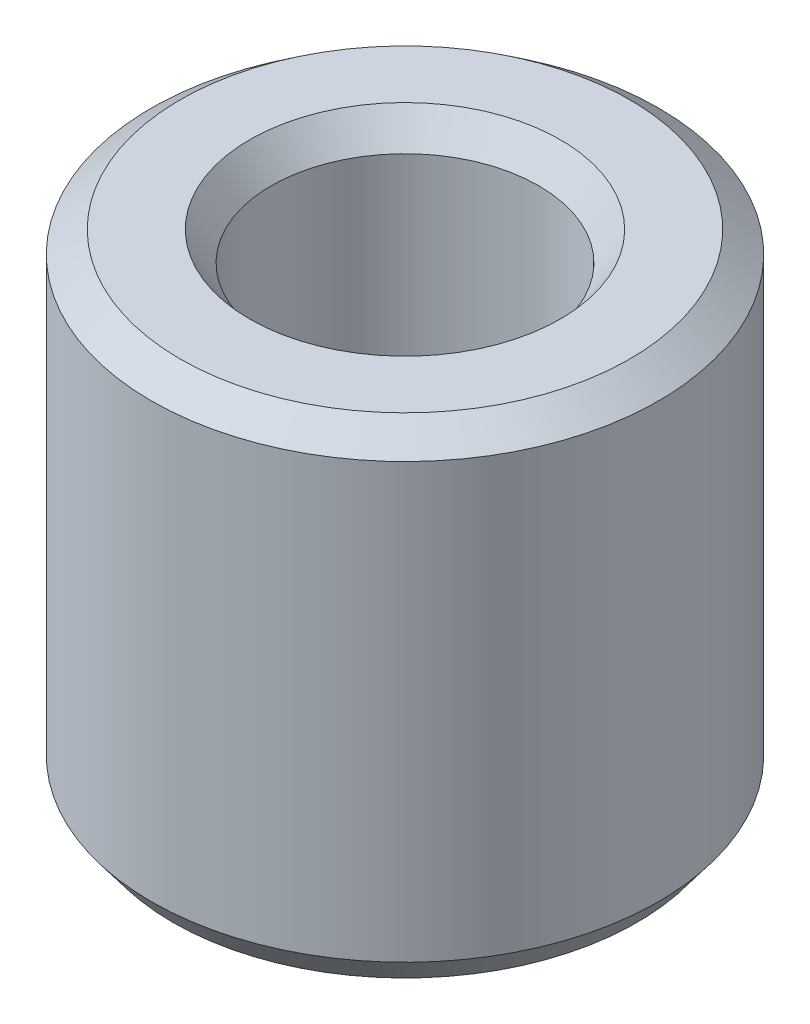
ISO-10303-21;
HEADER;
FILE_DESCRIPTION(('STEP AP214'),'2;1');
FILE_NAME('part.step','',(''),(''),'','','');
FILE_SCHEMA(('AUTOMOTIVE_DESIGN { 1 0 10303 214 1 1 1 1 }'));
ENDSEC;
DATA;
#1=APPLICATION_CONTEXT('core data for automotive mechanical design processes');
#2=APPLICATION_PROTOCOL_DEFINITION('international standard','automotive_design',2000,#1);
#3=PRODUCT_CONTEXT('',#1,'mechanical');
#4=PRODUCT('Part','Part','',(#3));
#5=PRODUCT_RELATED_PRODUCT_CATEGORY('part','',(#4));
#6=PRODUCT_DEFINITION_FORMATION('','',#4);
#7=PRODUCT_DEFINITION_CONTEXT('part definition',#1,'design');
#8=PRODUCT_DEFINITION('design','',#6,#7);
#9=PRODUCT_DEFINITION_SHAPE('','',#8);
#10=(LENGTH_UNIT() NAMED_UNIT(*) SI_UNIT(.MILLI.,.METRE.));
#11=(NAMED_UNIT(*) PLANE_ANGLE_UNIT() SI_UNIT($,.RADIAN.));
#12=(NAMED_UNIT(*) SI_UNIT($,.STERADIAN.) SOLID_ANGLE_UNIT());
#13=UNCERTAINTY_MEASURE_WITH_UNIT(LENGTH_MEASURE(1.E-05),#10,'distance_accuracy_value','');
#14=(GEOMETRIC_REPRESENTATION_CONTEXT(3) GLOBAL_UNCERTAINTY_ASSIGNED_CONTEXT((#13)) GLOBAL_UNIT_ASSIGNED_CONTEXT((#10,
#11,#12)) REPRESENTATION_CONTEXT('',''));
#15=CARTESIAN_POINT('',(0.,0.,0.));
#16=DIRECTION('',(0.,0.,1.));
#17=DIRECTION('',(1.,0.,0.));
#18=AXIS2_PLACEMENT_3D('',#15,#16,#17);
#19=CARTESIAN_POINT('',(0.,57.2840586924267,0.));
#20=DIRECTION('',(0.,-1.,0.));
#21=DIRECTION('',(0.,0.,-1.));
#22=AXIS2_PLACEMENT_3D('',#19,#20,#21);
#23=CYLINDRICAL_SURFACE('',#22,30.);
#24=CARTESIAN_POINT('',(0.,3.42523970771818,0.));
#25=DIRECTION('',(0.,1.,0.));
#26=DIRECTION('',(0.,0.,1.));
#27=AXIS2_PLACEMENT_3D('',#24,#25,#26);
#28=CIRCLE('',#27,30.);
#29=CARTESIAN_POINT('',(0.,3.42523970771818,30.));
#30=VERTEX_POINT('',#29);
#31=EDGE_CURVE('E10',#30,#30,#28,.T.);
#32=ORIENTED_EDGE('',*,*,#31,.T.);
#33=EDGE_LOOP('',(#32));
#34=FACE_BOUND('',#33,.T.);
#35=CARTESIAN_POINT('',(0.,54.7164377457477,0.));
#36=DIRECTION('',(0.,1.,0.));
#37=DIRECTION('',(0.,0.,1.));
#38=AXIS2_PLACEMENT_3D('',#35,#36,#37);
#39=CIRCLE('',#38,30.);
#40=CARTESIAN_POINT('',(0.,54.7164377457477,30.));
#41=VERTEX_POINT('',#40);
#42=EDGE_CURVE('E50',#41,#41,#39,.F.);
#43=ORIENTED_EDGE('',*,*,#42,.T.);
#44=EDGE_LOOP('',(#43));
#45=FACE_BOUND('',#44,.T.);
#46=ADVANCED_FACE('F39',(#34,#45),#23,.T.);
#47=CARTESIAN_POINT('',(0.,57.2840586924267,0.));
#48=DIRECTION('',(0.,1.,0.));
#49=DIRECTION('',(0.,0.,1.));
#50=AXIS2_PLACEMENT_3D('',#47,#48,#49);
#51=PLANE('',#50);
#52=CARTESIAN_POINT('',(0.,57.2840586924267,0.));
#53=DIRECTION('',(0.,1.,0.));
#54=DIRECTION('',(0.,0.,1.));
#55=AXIS2_PLACEMENT_3D('',#52,#53,#54);
#56=CIRCLE('',#55,18.3735227069098);
#57=CARTESIAN_POINT('',(0.,57.2840586924267,18.3735227069098));
#58=VERTEX_POINT('',#57);
#59=EDGE_CURVE('E58',#58,#58,#56,.F.);
#60=ORIENTED_EDGE('',*,*,#59,.T.);
#61=EDGE_LOOP('',(#60));
#62=FACE_BOUND('',#61,.T.);
#63=CARTESIAN_POINT('',(0.,57.2840586924267,0.));
#64=DIRECTION('',(0.,1.,0.));
#65=DIRECTION('',(0.,0.,1.));
#66=AXIS2_PLACEMENT_3D('',#63,#64,#65);
#67=CIRCLE('',#66,26.5747602922818);
#68=CARTESIAN_POINT('',(0.,57.2840586924267,26.5747602922818));
#69=VERTEX_POINT('',#68);
#70=EDGE_CURVE('E61',#69,#69,#67,.T.);
#71=ORIENTED_EDGE('',*,*,#70,.T.);
#72=EDGE_LOOP('',(#71));
#73=FACE_BOUND('',#72,.T.);
#74=ADVANCED_FACE('F88',(#62,#73),#51,.T.);
#75=CARTESIAN_POINT('',(0.,0.,0.));
#76=DIRECTION('',(0.,1.,0.));
#77=DIRECTION('',(0.,0.,1.));
#78=AXIS2_PLACEMENT_3D('',#75,#76,#77);
#79=PLANE('',#78);
#80=CARTESIAN_POINT('',(0.,0.,0.));
#81=DIRECTION('',(0.,1.,0.));
#82=DIRECTION('',(0.,0.,1.));
#83=AXIS2_PLACEMENT_3D('',#80,#81,#82);
#84=CIRCLE('',#83,19.231141467949);
#85=CARTESIAN_POINT('',(0.,0.,19.231141467949));
#86=VERTEX_POINT('',#85);
#87=EDGE_CURVE('E51',#86,#86,#84,.T.);
#88=ORIENTED_EDGE('',*,*,#87,.T.);
#89=EDGE_LOOP('',(#88));
#90=FACE_BOUND('',#89,.T.);
#91=CARTESIAN_POINT('',(0.,0.,0.));
#92=DIRECTION('',(0.,1.,0.));
#93=DIRECTION('',(0.,0.,1.));
#94=AXIS2_PLACEMENT_3D('',#91,#92,#93);
#95=CIRCLE('',#94,27.432379053321);
#96=CARTESIAN_POINT('',(0.,0.,27.432379053321));
#97=VERTEX_POINT('',#96);
#98=EDGE_CURVE('E54',#97,#97,#95,.F.);
#99=ORIENTED_EDGE('',*,*,#98,.T.);
#100=EDGE_LOOP('',(#99));
#101=FACE_BOUND('',#100,.T.);
#102=ADVANCED_FACE('F83',(#90,#101),#79,.F.);
#103=CARTESIAN_POINT('',(0.,57.2840586924267,0.));
#104=DIRECTION('',(0.,-1.,0.));
#105=DIRECTION('',(0.,0.,-1.));
#106=AXIS2_PLACEMENT_3D('',#103,#104,#105);
#107=CYLINDRICAL_SURFACE('',#106,15.8059017602309);
#108=CARTESIAN_POINT('',(0.,53.8588189847086,0.));
#109=DIRECTION('',(0.,1.,0.));
#110=DIRECTION('',(0.,0.,1.));
#111=AXIS2_PLACEMENT_3D('',#108,#109,#110);
#112=CIRCLE('',#111,15.8059017602309);
#113=CARTESIAN_POINT('',(0.,53.8588189847086,15.8059017602309));
#114=VERTEX_POINT('',#113);
#115=EDGE_CURVE('E67',#114,#114,#112,.T.);
#116=ORIENTED_EDGE('',*,*,#115,.T.);
#117=EDGE_LOOP('',(#116));
#118=FACE_BOUND('',#117,.T.);
#119=CARTESIAN_POINT('',(0.,2.56762094667898,0.));
#120=DIRECTION('',(0.,1.,0.));
#121=DIRECTION('',(0.,0.,1.));
#122=AXIS2_PLACEMENT_3D('',#119,#120,#121);
#123=CIRCLE('',#122,15.8059017602309);
#124=CARTESIAN_POINT('',(0.,2.56762094667898,15.8059017602309));
#125=VERTEX_POINT('',#124);
#126=EDGE_CURVE('E69',#125,#125,#123,.F.);
#127=ORIENTED_EDGE('',*,*,#126,.T.);
#128=EDGE_LOOP('',(#127));
#129=FACE_BOUND('',#128,.T.);
#130=ADVANCED_FACE('F71',(#118,#129),#107,.F.);
#131=CARTESIAN_POINT('',(0.,53.8588189847086,0.));
#132=DIRECTION('',(0.,1.,0.));
#133=DIRECTION('',(0.,0.,1.));
#134=AXIS2_PLACEMENT_3D('',#131,#132,#133);
#135=CONICAL_SURFACE('',#134,15.8059017602309,0.643256510589528);
#136=ORIENTED_EDGE('',*,*,#59,.F.);
#137=EDGE_LOOP('',(#136));
#138=FACE_BOUND('',#137,.T.);
#139=ORIENTED_EDGE('',*,*,#115,.F.);
#140=EDGE_LOOP('',(#139));
#141=FACE_BOUND('',#140,.T.);
#142=ADVANCED_FACE('F77',(#138,#141),#135,.F.);
#143=CARTESIAN_POINT('',(0.,0.,0.));
#144=DIRECTION('',(0.,-1.,0.));
#145=DIRECTION('',(0.,0.,-1.));
#146=AXIS2_PLACEMENT_3D('',#143,#144,#145);
#147=CONICAL_SURFACE('',#146,19.231141467949,0.927539816205365);
#148=ORIENTED_EDGE('',*,*,#126,.F.);
#149=EDGE_LOOP('',(#148));
#150=FACE_BOUND('',#149,.T.);
#151=ORIENTED_EDGE('',*,*,#87,.F.);
#152=EDGE_LOOP('',(#151));
#153=FACE_BOUND('',#152,.T.);
#154=ADVANCED_FACE('F73',(#150,#153),#147,.F.);
#155=CARTESIAN_POINT('',(0.,3.42523970771818,0.));
#156=DIRECTION('',(0.,1.,0.));
#157=DIRECTION('',(0.,0.,1.));
#158=AXIS2_PLACEMENT_3D('',#155,#156,#157);
#159=CONICAL_SURFACE('',#158,30.,0.64325651058953);
#160=ORIENTED_EDGE('',*,*,#98,.F.);
#161=EDGE_LOOP('',(#160));
#162=FACE_BOUND('',#161,.T.);
#163=ORIENTED_EDGE('',*,*,#31,.F.);
#164=EDGE_LOOP('',(#163));
#165=FACE_BOUND('',#164,.T.);
#166=ADVANCED_FACE('F76',(#162,#165),#159,.T.);
#167=CARTESIAN_POINT('',(0.,57.2840586924267,0.));
#168=DIRECTION('',(0.,-1.,0.));
#169=DIRECTION('',(0.,0.,-1.));
#170=AXIS2_PLACEMENT_3D('',#167,#168,#169);
#171=CONICAL_SURFACE('',#170,26.5747602922818,0.927539816205366);
#172=ORIENTED_EDGE('',*,*,#42,.F.);
#173=EDGE_LOOP('',(#172));
#174=FACE_BOUND('',#173,.T.);
#175=ORIENTED_EDGE('',*,*,#70,.F.);
#176=EDGE_LOOP('',(#175));
#177=FACE_BOUND('',#176,.T.);
#178=ADVANCED_FACE('F45',(#174,#177),#171,.T.);
#179=CLOSED_SHELL('',(#46,#74,#102,#130,#142,#154,#166,#178));
#180=MANIFOLD_SOLID_BREP('B2',#179);
#181=ADVANCED_BREP_SHAPE_REPRESENTATION('',(#18,#180),#14);
#182=SHAPE_DEFINITION_REPRESENTATION(#9,#181);
ENDSEC;
END-ISO-10303-21;
